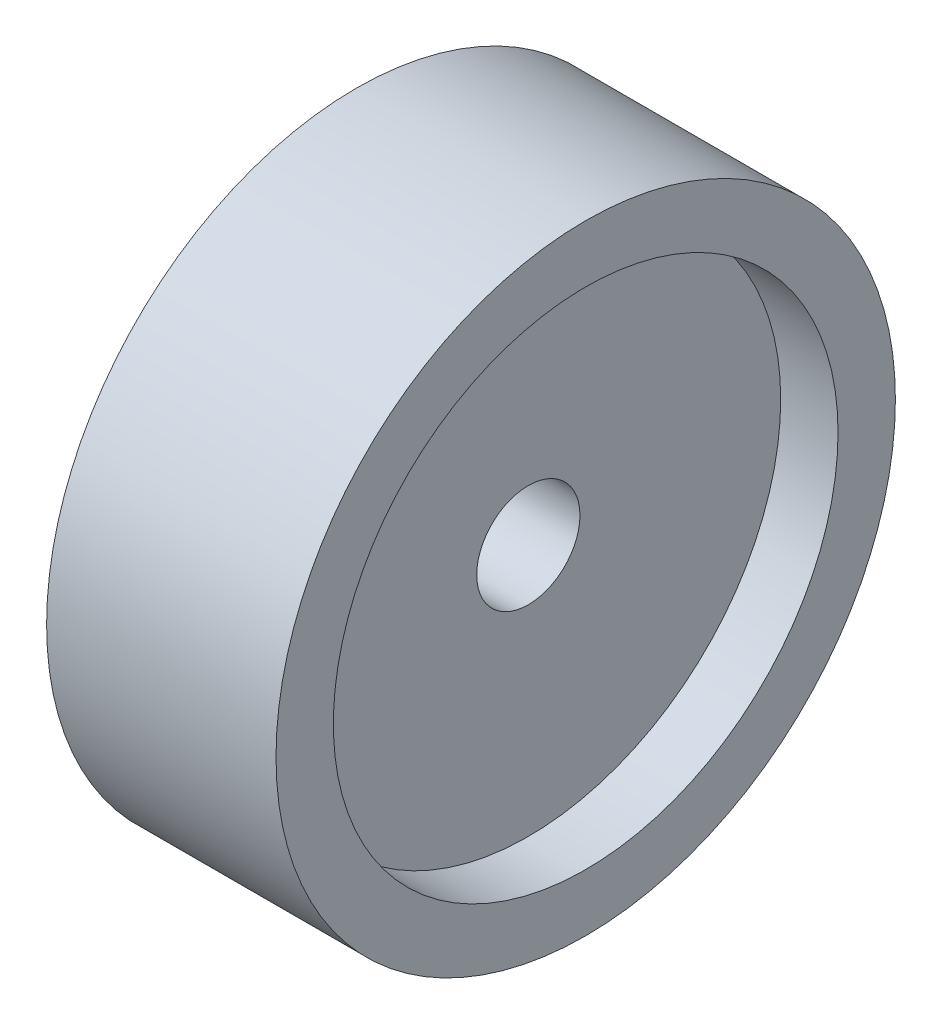
ISO-10303-21;
HEADER;
FILE_DESCRIPTION(('STEP AP214'),'2;1');
FILE_NAME('part.step','',(''),(''),'','','');
FILE_SCHEMA(('AUTOMOTIVE_DESIGN { 1 0 10303 214 1 1 1 1 }'));
ENDSEC;
DATA;
#1=APPLICATION_CONTEXT('core data for automotive mechanical design processes');
#2=APPLICATION_PROTOCOL_DEFINITION('international standard','automotive_design',2000,#1);
#3=PRODUCT_CONTEXT('',#1,'mechanical');
#4=PRODUCT('Part','Part','',(#3));
#5=PRODUCT_RELATED_PRODUCT_CATEGORY('part','',(#4));
#6=PRODUCT_DEFINITION_FORMATION('','',#4);
#7=PRODUCT_DEFINITION_CONTEXT('part definition',#1,'design');
#8=PRODUCT_DEFINITION('design','',#6,#7);
#9=PRODUCT_DEFINITION_SHAPE('','',#8);
#10=(LENGTH_UNIT() NAMED_UNIT(*) SI_UNIT(.MILLI.,.METRE.));
#11=(NAMED_UNIT(*) PLANE_ANGLE_UNIT() SI_UNIT($,.RADIAN.));
#12=(NAMED_UNIT(*) SI_UNIT($,.STERADIAN.) SOLID_ANGLE_UNIT());
#13=UNCERTAINTY_MEASURE_WITH_UNIT(LENGTH_MEASURE(1.E-05),#10,'distance_accuracy_value','');
#14=(GEOMETRIC_REPRESENTATION_CONTEXT(3) GLOBAL_UNCERTAINTY_ASSIGNED_CONTEXT((#13)) GLOBAL_UNIT_ASSIGNED_CONTEXT((#10,
#11,#12)) REPRESENTATION_CONTEXT('',''));
#15=CARTESIAN_POINT('',(0.,0.,0.));
#16=DIRECTION('',(0.,0.,1.));
#17=DIRECTION('',(1.,0.,0.));
#18=AXIS2_PLACEMENT_3D('',#15,#16,#17);
#19=CARTESIAN_POINT('',(20.,0.,0.));
#20=DIRECTION('',(-1.,0.,0.));
#21=DIRECTION('',(0.,0.,1.));
#22=AXIS2_PLACEMENT_3D('',#19,#20,#21);
#23=CYLINDRICAL_SURFACE('',#22,4.5);
#24=CARTESIAN_POINT('',(3.,0.,0.));
#25=DIRECTION('',(-1.,0.,0.));
#26=DIRECTION('',(0.,0.,1.));
#27=AXIS2_PLACEMENT_3D('',#24,#25,#26);
#28=CIRCLE('',#27,4.5);
#29=CARTESIAN_POINT('',(3.,0.,4.5));
#30=VERTEX_POINT('',#29);
#31=EDGE_CURVE('E42',#30,#30,#28,.T.);
#32=ORIENTED_EDGE('',*,*,#31,.T.);
#33=EDGE_LOOP('',(#32));
#34=FACE_BOUND('',#33,.T.);
#35=CARTESIAN_POINT('',(15.,0.,0.));
#36=DIRECTION('',(1.,0.,0.));
#37=DIRECTION('',(0.,0.,-1.));
#38=AXIS2_PLACEMENT_3D('',#35,#36,#37);
#39=CIRCLE('',#38,4.5);
#40=CARTESIAN_POINT('',(15.,0.,-4.5));
#41=VERTEX_POINT('',#40);
#42=EDGE_CURVE('E33',#41,#41,#39,.T.);
#43=ORIENTED_EDGE('',*,*,#42,.T.);
#44=EDGE_LOOP('',(#43));
#45=FACE_BOUND('',#44,.T.);
#46=ADVANCED_FACE('F29',(#34,#45),#23,.F.);
#47=CARTESIAN_POINT('',(20.,0.,0.));
#48=DIRECTION('',(1.,0.,0.));
#49=DIRECTION('',(0.,0.,-1.));
#50=AXIS2_PLACEMENT_3D('',#47,#48,#49);
#51=PLANE('',#50);
#52=CARTESIAN_POINT('',(20.,0.,0.));
#53=DIRECTION('',(1.,0.,0.));
#54=DIRECTION('',(0.,0.,-1.));
#55=AXIS2_PLACEMENT_3D('',#52,#53,#54);
#56=CIRCLE('',#55,22.);
#57=CARTESIAN_POINT('',(20.,0.,-22.));
#58=VERTEX_POINT('',#57);
#59=EDGE_CURVE('E59',#58,#58,#56,.T.);
#60=ORIENTED_EDGE('',*,*,#59,.F.);
#61=EDGE_LOOP('',(#60));
#62=FACE_BOUND('',#61,.T.);
#63=CARTESIAN_POINT('',(20.,0.,0.));
#64=DIRECTION('',(1.,0.,0.));
#65=DIRECTION('',(0.,0.,-1.));
#66=AXIS2_PLACEMENT_3D('',#63,#64,#65);
#67=CIRCLE('',#66,27.);
#68=CARTESIAN_POINT('',(20.,0.,-27.));
#69=VERTEX_POINT('',#68);
#70=EDGE_CURVE('E10',#69,#69,#67,.T.);
#71=ORIENTED_EDGE('',*,*,#70,.T.);
#72=EDGE_LOOP('',(#71));
#73=FACE_BOUND('',#72,.T.);
#74=ADVANCED_FACE('F65',(#62,#73),#51,.T.);
#75=CARTESIAN_POINT('',(0.,0.,0.));
#76=DIRECTION('',(1.,0.,0.));
#77=DIRECTION('',(0.,0.,-1.));
#78=AXIS2_PLACEMENT_3D('',#75,#76,#77);
#79=PLANE('',#78);
#80=CARTESIAN_POINT('',(0.,0.,0.));
#81=DIRECTION('',(-1.,0.,0.));
#82=DIRECTION('',(0.,0.,1.));
#83=AXIS2_PLACEMENT_3D('',#80,#81,#82);
#84=CIRCLE('',#83,22.);
#85=CARTESIAN_POINT('',(0.,0.,22.));
#86=VERTEX_POINT('',#85);
#87=EDGE_CURVE('E50',#86,#86,#84,.T.);
#88=ORIENTED_EDGE('',*,*,#87,.F.);
#89=EDGE_LOOP('',(#88));
#90=FACE_BOUND('',#89,.T.);
#91=CARTESIAN_POINT('',(0.,0.,0.));
#92=DIRECTION('',(1.,0.,0.));
#93=DIRECTION('',(0.,0.,-1.));
#94=AXIS2_PLACEMENT_3D('',#91,#92,#93);
#95=CIRCLE('',#94,27.);
#96=CARTESIAN_POINT('',(0.,0.,-27.));
#97=VERTEX_POINT('',#96);
#98=EDGE_CURVE('E37',#97,#97,#95,.T.);
#99=ORIENTED_EDGE('',*,*,#98,.F.);
#100=EDGE_LOOP('',(#99));
#101=FACE_BOUND('',#100,.T.);
#102=ADVANCED_FACE('F67',(#90,#101),#79,.F.);
#103=CARTESIAN_POINT('',(20.,0.,0.));
#104=DIRECTION('',(-1.,0.,0.));
#105=DIRECTION('',(0.,0.,1.));
#106=AXIS2_PLACEMENT_3D('',#103,#104,#105);
#107=CYLINDRICAL_SURFACE('',#106,27.);
#108=ORIENTED_EDGE('',*,*,#70,.F.);
#109=EDGE_LOOP('',(#108));
#110=FACE_BOUND('',#109,.T.);
#111=ORIENTED_EDGE('',*,*,#98,.T.);
#112=EDGE_LOOP('',(#111));
#113=FACE_BOUND('',#112,.T.);
#114=ADVANCED_FACE('F31',(#110,#113),#107,.T.);
#115=CARTESIAN_POINT('',(3.,0.,0.));
#116=DIRECTION('',(-1.,0.,0.));
#117=DIRECTION('',(0.,0.,1.));
#118=AXIS2_PLACEMENT_3D('',#115,#116,#117);
#119=CYLINDRICAL_SURFACE('',#118,22.);
#120=CARTESIAN_POINT('',(3.,0.,0.));
#121=DIRECTION('',(-1.,0.,0.));
#122=DIRECTION('',(0.,0.,1.));
#123=AXIS2_PLACEMENT_3D('',#120,#121,#122);
#124=CIRCLE('',#123,22.);
#125=CARTESIAN_POINT('',(3.,0.,22.));
#126=VERTEX_POINT('',#125);
#127=EDGE_CURVE('E46',#126,#126,#124,.T.);
#128=ORIENTED_EDGE('',*,*,#127,.F.);
#129=EDGE_LOOP('',(#128));
#130=FACE_BOUND('',#129,.T.);
#131=ORIENTED_EDGE('',*,*,#87,.T.);
#132=EDGE_LOOP('',(#131));
#133=FACE_BOUND('',#132,.T.);
#134=ADVANCED_FACE('F77',(#130,#133),#119,.F.);
#135=CARTESIAN_POINT('',(3.,0.,0.));
#136=DIRECTION('',(-1.,0.,0.));
#137=DIRECTION('',(0.,0.,1.));
#138=AXIS2_PLACEMENT_3D('',#135,#136,#137);
#139=PLANE('',#138);
#140=ORIENTED_EDGE('',*,*,#31,.F.);
#141=EDGE_LOOP('',(#140));
#142=FACE_BOUND('',#141,.T.);
#143=ORIENTED_EDGE('',*,*,#127,.T.);
#144=EDGE_LOOP('',(#143));
#145=FACE_BOUND('',#144,.T.);
#146=ADVANCED_FACE('F80',(#142,#145),#139,.T.);
#147=CARTESIAN_POINT('',(15.,0.,0.));
#148=DIRECTION('',(1.,0.,0.));
#149=DIRECTION('',(0.,0.,-1.));
#150=AXIS2_PLACEMENT_3D('',#147,#148,#149);
#151=CYLINDRICAL_SURFACE('',#150,22.);
#152=CARTESIAN_POINT('',(15.,0.,0.));
#153=DIRECTION('',(1.,0.,0.));
#154=DIRECTION('',(0.,0.,-1.));
#155=AXIS2_PLACEMENT_3D('',#152,#153,#154);
#156=CIRCLE('',#155,22.);
#157=CARTESIAN_POINT('',(15.,0.,-22.));
#158=VERTEX_POINT('',#157);
#159=EDGE_CURVE('E56',#158,#158,#156,.T.);
#160=ORIENTED_EDGE('',*,*,#159,.F.);
#161=EDGE_LOOP('',(#160));
#162=FACE_BOUND('',#161,.T.);
#163=ORIENTED_EDGE('',*,*,#59,.T.);
#164=EDGE_LOOP('',(#163));
#165=FACE_BOUND('',#164,.T.);
#166=ADVANCED_FACE('F63',(#162,#165),#151,.F.);
#167=CARTESIAN_POINT('',(15.,0.,0.));
#168=DIRECTION('',(1.,0.,0.));
#169=DIRECTION('',(0.,0.,-1.));
#170=AXIS2_PLACEMENT_3D('',#167,#168,#169);
#171=PLANE('',#170);
#172=ORIENTED_EDGE('',*,*,#42,.F.);
#173=EDGE_LOOP('',(#172));
#174=FACE_BOUND('',#173,.T.);
#175=ORIENTED_EDGE('',*,*,#159,.T.);
#176=EDGE_LOOP('',(#175));
#177=FACE_BOUND('',#176,.T.);
#178=ADVANCED_FACE('F86',(#174,#177),#171,.T.);
#179=CLOSED_SHELL('',(#46,#74,#102,#114,#134,#146,#166,#178));
#180=MANIFOLD_SOLID_BREP('B2',#179);
#181=ADVANCED_BREP_SHAPE_REPRESENTATION('',(#18,#180),#14);
#182=SHAPE_DEFINITION_REPRESENTATION(#9,#181);
ENDSEC;
END-ISO-10303-21;
